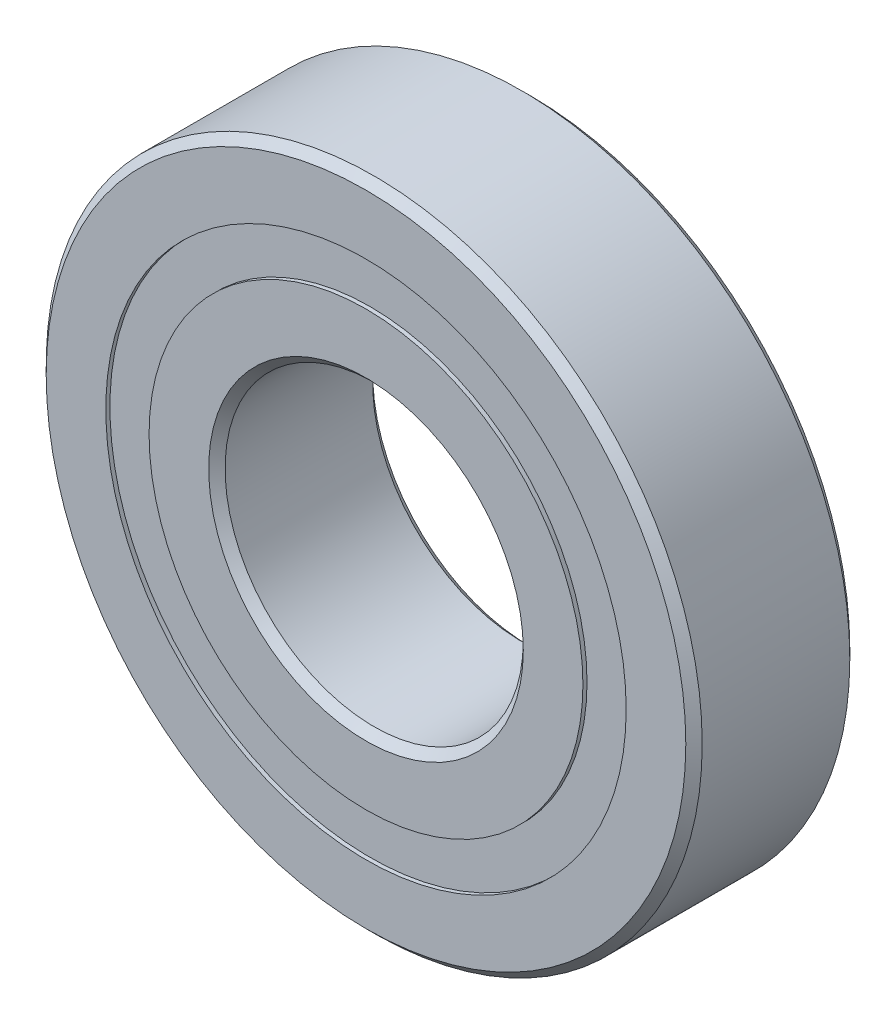
ISO-10303-21;
HEADER;
FILE_DESCRIPTION(('STEP AP214'),'2;1');
FILE_NAME('part.step','',(''),(''),'','','');
FILE_SCHEMA(('AUTOMOTIVE_DESIGN { 1 0 10303 214 1 1 1 1 }'));
ENDSEC;
DATA;
#1=APPLICATION_CONTEXT('core data for automotive mechanical design processes');
#2=APPLICATION_PROTOCOL_DEFINITION('international standard','automotive_design',2000,#1);
#3=PRODUCT_CONTEXT('',#1,'mechanical');
#4=PRODUCT('Part','Part','',(#3));
#5=PRODUCT_RELATED_PRODUCT_CATEGORY('part','',(#4));
#6=PRODUCT_DEFINITION_FORMATION('','',#4);
#7=PRODUCT_DEFINITION_CONTEXT('part definition',#1,'design');
#8=PRODUCT_DEFINITION('design','',#6,#7);
#9=PRODUCT_DEFINITION_SHAPE('','',#8);
#10=(LENGTH_UNIT() NAMED_UNIT(*) SI_UNIT(.MILLI.,.METRE.));
#11=(NAMED_UNIT(*) PLANE_ANGLE_UNIT() SI_UNIT($,.RADIAN.));
#12=(NAMED_UNIT(*) SI_UNIT($,.STERADIAN.) SOLID_ANGLE_UNIT());
#13=UNCERTAINTY_MEASURE_WITH_UNIT(LENGTH_MEASURE(1.E-05),#10,'distance_accuracy_value','');
#14=(GEOMETRIC_REPRESENTATION_CONTEXT(3) GLOBAL_UNCERTAINTY_ASSIGNED_CONTEXT((#13)) GLOBAL_UNIT_ASSIGNED_CONTEXT((#10,
#11,#12)) REPRESENTATION_CONTEXT('',''));
#15=CARTESIAN_POINT('',(0.,0.,0.));
#16=DIRECTION('',(0.,0.,1.));
#17=DIRECTION('',(1.,0.,0.));
#18=AXIS2_PLACEMENT_3D('',#15,#16,#17);
#19=CARTESIAN_POINT('',(0.,13.8513736263736,-4.14734375));
#20=DIRECTION('',(0.,0.,1.));
#21=DIRECTION('',(1.,0.,0.));
#22=AXIS2_PLACEMENT_3D('',#19,#20,#21);
#23=PLANE('',#22);
#24=CARTESIAN_POINT('',(0.,0.,-4.14734375));
#25=DIRECTION('',(0.,0.,1.));
#26=DIRECTION('',(1.,0.,0.));
#27=AXIS2_PLACEMENT_3D('',#24,#25,#26);
#28=CIRCLE('',#27,13.8513736263736);
#29=CARTESIAN_POINT('',(13.8513736263736,0.,-4.14734375));
#30=VERTEX_POINT('',#29);
#31=EDGE_CURVE('E55',#30,#30,#28,.T.);
#32=ORIENTED_EDGE('',*,*,#31,.F.);
#33=EDGE_LOOP('',(#32));
#34=FACE_BOUND('',#33,.T.);
#35=CARTESIAN_POINT('',(0.,0.,-4.14734375));
#36=DIRECTION('',(0.,0.,1.));
#37=DIRECTION('',(1.,0.,0.));
#38=AXIS2_PLACEMENT_3D('',#35,#36,#37);
#39=CIRCLE('',#38,11.5486263736264);
#40=CARTESIAN_POINT('',(11.5486263736264,0.,-4.14734375));
#41=VERTEX_POINT('',#40);
#42=EDGE_CURVE('E11',#41,#41,#39,.T.);
#43=ORIENTED_EDGE('',*,*,#42,.T.);
#44=EDGE_LOOP('',(#43));
#45=FACE_BOUND('',#44,.T.);
#46=ADVANCED_FACE('F41',(#34,#45),#23,.F.);
#47=CARTESIAN_POINT('',(0.,0.,4.365625));
#48=DIRECTION('',(0.,0.,1.));
#49=DIRECTION('',(1.,0.,0.));
#50=AXIS2_PLACEMENT_3D('',#47,#48,#49);
#51=CYLINDRICAL_SURFACE('',#50,11.5486263736264);
#52=ORIENTED_EDGE('',*,*,#42,.F.);
#53=EDGE_LOOP('',(#52));
#54=FACE_BOUND('',#53,.T.);
#55=CARTESIAN_POINT('',(0.,0.,-2.25617798111032));
#56=DIRECTION('',(0.,0.,1.));
#57=DIRECTION('',(1.,0.,0.));
#58=AXIS2_PLACEMENT_3D('',#55,#56,#57);
#59=CIRCLE('',#58,11.5486263736264);
#60=CARTESIAN_POINT('',(11.5486263736264,0.,-2.25617798111032));
#61=VERTEX_POINT('',#60);
#62=EDGE_CURVE('E47',#61,#61,#59,.T.);
#63=ORIENTED_EDGE('',*,*,#62,.T.);
#64=EDGE_LOOP('',(#63));
#65=FACE_BOUND('',#64,.T.);
#66=ADVANCED_FACE('F64',(#54,#65),#51,.F.);
#67=CARTESIAN_POINT('',(0.,13.8513736263736,-2.25617798111032));
#68=DIRECTION('',(0.,0.,-1.));
#69=DIRECTION('',(-1.,0.,0.));
#70=AXIS2_PLACEMENT_3D('',#67,#68,#69);
#71=PLANE('',#70);
#72=ORIENTED_EDGE('',*,*,#62,.F.);
#73=EDGE_LOOP('',(#72));
#74=FACE_BOUND('',#73,.T.);
#75=CARTESIAN_POINT('',(0.,0.,-2.25617798111032));
#76=DIRECTION('',(0.,0.,1.));
#77=DIRECTION('',(1.,0.,0.));
#78=AXIS2_PLACEMENT_3D('',#75,#76,#77);
#79=CIRCLE('',#78,13.8513736263736);
#80=CARTESIAN_POINT('',(13.8513736263736,0.,-2.25617798111032));
#81=VERTEX_POINT('',#80);
#82=EDGE_CURVE('E51',#81,#81,#79,.T.);
#83=ORIENTED_EDGE('',*,*,#82,.T.);
#84=EDGE_LOOP('',(#83));
#85=FACE_BOUND('',#84,.T.);
#86=ADVANCED_FACE('F68',(#74,#85),#71,.F.);
#87=CARTESIAN_POINT('',(0.,0.,4.365625));
#88=DIRECTION('',(0.,0.,1.));
#89=DIRECTION('',(1.,0.,0.));
#90=AXIS2_PLACEMENT_3D('',#87,#88,#89);
#91=CYLINDRICAL_SURFACE('',#90,13.8513736263736);
#92=ORIENTED_EDGE('',*,*,#82,.F.);
#93=EDGE_LOOP('',(#92));
#94=FACE_BOUND('',#93,.T.);
#95=ORIENTED_EDGE('',*,*,#31,.T.);
#96=EDGE_LOOP('',(#95));
#97=FACE_BOUND('',#96,.T.);
#98=ADVANCED_FACE('F61',(#94,#97),#91,.T.);
#99=CLOSED_SHELL('',(#46,#66,#86,#98));
#100=MANIFOLD_SOLID_BREP('B2',#99);
#101=CARTESIAN_POINT('',(0.,13.8513736263736,4.14734375));
#102=DIRECTION('',(0.,0.,-1.));
#103=DIRECTION('',(-1.,0.,0.));
#104=AXIS2_PLACEMENT_3D('',#101,#102,#103);
#105=PLANE('',#104);
#106=CARTESIAN_POINT('',(0.,0.,4.14734375));
#107=DIRECTION('',(0.,0.,1.));
#108=DIRECTION('',(1.,0.,0.));
#109=AXIS2_PLACEMENT_3D('',#106,#107,#108);
#110=CIRCLE('',#109,11.5486263736264);
#111=CARTESIAN_POINT('',(11.5486263736264,0.,4.14734375));
#112=VERTEX_POINT('',#111);
#113=EDGE_CURVE('E40',#112,#112,#110,.T.);
#114=ORIENTED_EDGE('',*,*,#113,.F.);
#115=EDGE_LOOP('',(#114));
#116=FACE_BOUND('',#115,.T.);
#117=CARTESIAN_POINT('',(0.,0.,4.14734375));
#118=DIRECTION('',(0.,0.,1.));
#119=DIRECTION('',(1.,0.,0.));
#120=AXIS2_PLACEMENT_3D('',#117,#118,#119);
#121=CIRCLE('',#120,13.8513736263736);
#122=CARTESIAN_POINT('',(13.8513736263736,0.,4.14734375));
#123=VERTEX_POINT('',#122);
#124=EDGE_CURVE('E122',#123,#123,#121,.T.);
#125=ORIENTED_EDGE('',*,*,#124,.T.);
#126=EDGE_LOOP('',(#125));
#127=FACE_BOUND('',#126,.T.);
#128=ADVANCED_FACE('F108',(#116,#127),#105,.F.);
#129=CARTESIAN_POINT('',(0.,0.,4.365625));
#130=DIRECTION('',(0.,0.,1.));
#131=DIRECTION('',(1.,0.,0.));
#132=AXIS2_PLACEMENT_3D('',#129,#130,#131);
#133=CYLINDRICAL_SURFACE('',#132,11.5486263736264);
#134=CARTESIAN_POINT('',(0.,0.,2.25617798111032));
#135=DIRECTION('',(0.,0.,1.));
#136=DIRECTION('',(1.,0.,0.));
#137=AXIS2_PLACEMENT_3D('',#134,#135,#136);
#138=CIRCLE('',#137,11.5486263736264);
#139=CARTESIAN_POINT('',(11.5486263736264,0.,2.25617798111032));
#140=VERTEX_POINT('',#139);
#141=EDGE_CURVE('E114',#140,#140,#138,.T.);
#142=ORIENTED_EDGE('',*,*,#141,.F.);
#143=EDGE_LOOP('',(#142));
#144=FACE_BOUND('',#143,.T.);
#145=ORIENTED_EDGE('',*,*,#113,.T.);
#146=EDGE_LOOP('',(#145));
#147=FACE_BOUND('',#146,.T.);
#148=ADVANCED_FACE('F137',(#144,#147),#133,.F.);
#149=CARTESIAN_POINT('',(0.,13.8513736263736,2.25617798111032));
#150=DIRECTION('',(0.,0.,1.));
#151=DIRECTION('',(1.,0.,0.));
#152=AXIS2_PLACEMENT_3D('',#149,#150,#151);
#153=PLANE('',#152);
#154=CARTESIAN_POINT('',(0.,0.,2.25617798111032));
#155=DIRECTION('',(0.,0.,1.));
#156=DIRECTION('',(1.,0.,0.));
#157=AXIS2_PLACEMENT_3D('',#154,#155,#156);
#158=CIRCLE('',#157,13.8513736263736);
#159=CARTESIAN_POINT('',(13.8513736263736,0.,2.25617798111032));
#160=VERTEX_POINT('',#159);
#161=EDGE_CURVE('E118',#160,#160,#158,.T.);
#162=ORIENTED_EDGE('',*,*,#161,.F.);
#163=EDGE_LOOP('',(#162));
#164=FACE_BOUND('',#163,.T.);
#165=ORIENTED_EDGE('',*,*,#141,.T.);
#166=EDGE_LOOP('',(#165));
#167=FACE_BOUND('',#166,.T.);
#168=ADVANCED_FACE('F132',(#164,#167),#153,.F.);
#169=CARTESIAN_POINT('',(0.,0.,4.365625));
#170=DIRECTION('',(0.,0.,1.));
#171=DIRECTION('',(1.,0.,0.));
#172=AXIS2_PLACEMENT_3D('',#169,#170,#171);
#173=CYLINDRICAL_SURFACE('',#172,13.8513736263736);
#174=ORIENTED_EDGE('',*,*,#124,.F.);
#175=EDGE_LOOP('',(#174));
#176=FACE_BOUND('',#175,.T.);
#177=ORIENTED_EDGE('',*,*,#161,.T.);
#178=EDGE_LOOP('',(#177));
#179=FACE_BOUND('',#178,.T.);
#180=ADVANCED_FACE('F129',(#176,#179),#173,.T.);
#181=CLOSED_SHELL('',(#128,#148,#168,#180));
#182=MANIFOLD_SOLID_BREP('B6',#181);
#183=CARTESIAN_POINT('',(-7.46487270411427,10.2745158285619,0.));
#184=DIRECTION('',(0.,0.,1.));
#185=DIRECTION('',(-0.587785252292462,0.809016994374955,0.));
#186=AXIS2_PLACEMENT_3D('',#183,#184,#185);
#187=SPHERICAL_SURFACE('',#186,2.25617798111032);
#188=CARTESIAN_POINT('',(-7.46487270411427,10.2745158285619,2.25617798111032));
#189=VERTEX_POINT('',#188);
#190=VERTEX_LOOP('',#189);
#191=FACE_BOUND('',#190,.T.);
#192=ADVANCED_FACE('F175',(#191),#187,.T.);
#193=CLOSED_SHELL('',(#192));
#194=MANIFOLD_SOLID_BREP('B35',#193);
#195=CARTESIAN_POINT('',(-12.0784177569484,3.92451582856197,0.));
#196=DIRECTION('',(0.,0.,1.));
#197=DIRECTION('',(-0.95105651629515,0.309016994374958,0.));
#198=AXIS2_PLACEMENT_3D('',#195,#196,#197);
#199=SPHERICAL_SURFACE('',#198,2.25617798111032);
#200=CARTESIAN_POINT('',(-12.0784177569484,3.92451582856197,2.25617798111032));
#201=VERTEX_POINT('',#200);
#202=VERTEX_LOOP('',#201);
#203=FACE_BOUND('',#202,.T.);
#204=ADVANCED_FACE('F195',(#203),#199,.T.);
#205=CLOSED_SHELL('',(#204));
#206=MANIFOLD_SOLID_BREP('B104',#205);
#207=CARTESIAN_POINT('',(-12.0784177569485,-3.92451582856172,0.));
#208=DIRECTION('',(0.,0.,1.));
#209=DIRECTION('',(-0.951056516295157,-0.309016994374938,0.));
#210=AXIS2_PLACEMENT_3D('',#207,#208,#209);
#211=SPHERICAL_SURFACE('',#210,2.25617798111032);
#212=CARTESIAN_POINT('',(-12.0784177569485,-3.92451582856172,2.25617798111032));
#213=VERTEX_POINT('',#212);
#214=VERTEX_LOOP('',#213);
#215=FACE_BOUND('',#214,.T.);
#216=ADVANCED_FACE('F215',(#215),#211,.T.);
#217=CLOSED_SHELL('',(#216));
#218=MANIFOLD_SOLID_BREP('B171',#217);
#219=CARTESIAN_POINT('',(-7.4648727041145,-10.2745158285618,0.));
#220=DIRECTION('',(0.,0.,1.));
#221=DIRECTION('',(-0.58778525229248,-0.809016994374942,0.));
#222=AXIS2_PLACEMENT_3D('',#219,#220,#221);
#223=SPHERICAL_SURFACE('',#222,2.25617798111032);
#224=CARTESIAN_POINT('',(-7.4648727041145,-10.2745158285618,2.25617798111032));
#225=VERTEX_POINT('',#224);
#226=VERTEX_LOOP('',#225);
#227=FACE_BOUND('',#226,.T.);
#228=ADVANCED_FACE('F235',(#227),#223,.T.);
#229=CLOSED_SHELL('',(#228));
#230=MANIFOLD_SOLID_BREP('B191',#229);
#231=CARTESIAN_POINT('',(0.,-12.7,0.));
#232=DIRECTION('',(0.,0.,1.));
#233=DIRECTION('',(0.,-1.,0.));
#234=AXIS2_PLACEMENT_3D('',#231,#232,#233);
#235=SPHERICAL_SURFACE('',#234,2.25617798111032);
#236=CARTESIAN_POINT('',(0.,-12.7,2.25617798111032));
#237=VERTEX_POINT('',#236);
#238=VERTEX_LOOP('',#237);
#239=FACE_BOUND('',#238,.T.);
#240=ADVANCED_FACE('F255',(#239),#235,.T.);
#241=CLOSED_SHELL('',(#240));
#242=MANIFOLD_SOLID_BREP('B211',#241);
#243=CARTESIAN_POINT('',(7.46487270411435,-10.2745158285619,0.));
#244=DIRECTION('',(0.,0.,1.));
#245=DIRECTION('',(0.587785252292469,-0.809016994374951,0.));
#246=AXIS2_PLACEMENT_3D('',#243,#244,#245);
#247=SPHERICAL_SURFACE('',#246,2.25617798111032);
#248=CARTESIAN_POINT('',(7.46487270411435,-10.2745158285619,2.25617798111032));
#249=VERTEX_POINT('',#248);
#250=VERTEX_LOOP('',#249);
#251=FACE_BOUND('',#250,.T.);
#252=ADVANCED_FACE('F275',(#251),#247,.T.);
#253=CLOSED_SHELL('',(#252));
#254=MANIFOLD_SOLID_BREP('B231',#253);
#255=CARTESIAN_POINT('',(12.0784177569484,-3.92451582856189,0.));
#256=DIRECTION('',(0.,0.,1.));
#257=DIRECTION('',(0.951056516295152,-0.309016994374952,0.));
#258=AXIS2_PLACEMENT_3D('',#255,#256,#257);
#259=SPHERICAL_SURFACE('',#258,2.25617798111032);
#260=CARTESIAN_POINT('',(12.0784177569484,-3.92451582856189,2.25617798111032));
#261=VERTEX_POINT('',#260);
#262=VERTEX_LOOP('',#261);
#263=FACE_BOUND('',#262,.T.);
#264=ADVANCED_FACE('F295',(#263),#259,.T.);
#265=CLOSED_SHELL('',(#264));
#266=MANIFOLD_SOLID_BREP('B251',#265);
#267=CARTESIAN_POINT('',(12.0784177569485,3.9245158285618,0.));
#268=DIRECTION('',(0.,0.,1.));
#269=DIRECTION('',(0.951056516295155,0.309016994374945,0.));
#270=AXIS2_PLACEMENT_3D('',#267,#268,#269);
#271=SPHERICAL_SURFACE('',#270,2.25617798111032);
#272=CARTESIAN_POINT('',(12.0784177569485,3.9245158285618,2.25617798111032));
#273=VERTEX_POINT('',#272);
#274=VERTEX_LOOP('',#273);
#275=FACE_BOUND('',#274,.T.);
#276=ADVANCED_FACE('F315',(#275),#271,.T.);
#277=CLOSED_SHELL('',(#276));
#278=MANIFOLD_SOLID_BREP('B271',#277);
#279=CARTESIAN_POINT('',(7.46487270411442,10.2745158285618,0.));
#280=DIRECTION('',(0.,0.,1.));
#281=DIRECTION('',(0.587785252292474,0.809016994374947,0.));
#282=AXIS2_PLACEMENT_3D('',#279,#280,#281);
#283=SPHERICAL_SURFACE('',#282,2.25617798111032);
#284=CARTESIAN_POINT('',(7.46487270411442,10.2745158285618,2.25617798111032));
#285=VERTEX_POINT('',#284);
#286=VERTEX_LOOP('',#285);
#287=FACE_BOUND('',#286,.T.);
#288=ADVANCED_FACE('F335',(#287),#283,.T.);
#289=CLOSED_SHELL('',(#288));
#290=MANIFOLD_SOLID_BREP('B291',#289);
#291=CARTESIAN_POINT('',(0.,12.7,0.));
#292=DIRECTION('',(0.,0.,1.));
#293=DIRECTION('',(0.,1.,0.));
#294=AXIS2_PLACEMENT_3D('',#291,#292,#293);
#295=SPHERICAL_SURFACE('',#294,2.25617798111032);
#296=CARTESIAN_POINT('',(0.,12.7,2.25617798111032));
#297=VERTEX_POINT('',#296);
#298=VERTEX_LOOP('',#297);
#299=FACE_BOUND('',#298,.T.);
#300=ADVANCED_FACE('F357',(#299),#295,.T.);
#301=CLOSED_SHELL('',(#300));
#302=MANIFOLD_SOLID_BREP('B311',#301);
#303=CARTESIAN_POINT('',(0.,11.5486263736264,4.365625));
#304=DIRECTION('',(0.,0.,-1.));
#305=DIRECTION('',(-1.,0.,0.));
#306=AXIS2_PLACEMENT_3D('',#303,#304,#305);
#307=PLANE('',#306);
#308=CARTESIAN_POINT('',(0.,0.,4.365625));
#309=DIRECTION('',(0.,0.,1.));
#310=DIRECTION('',(1.,0.,0.));
#311=AXIS2_PLACEMENT_3D('',#308,#309,#310);
#312=CIRCLE('',#311,8.3740625);
#313=CARTESIAN_POINT('',(8.3740625,0.,4.365625));
#314=VERTEX_POINT('',#313);
#315=EDGE_CURVE('E404',#314,#314,#312,.T.);
#316=ORIENTED_EDGE('',*,*,#315,.F.);
#317=EDGE_LOOP('',(#316));
#318=FACE_BOUND('',#317,.T.);
#319=CARTESIAN_POINT('',(0.,0.,4.365625));
#320=DIRECTION('',(0.,0.,1.));
#321=DIRECTION('',(1.,0.,0.));
#322=AXIS2_PLACEMENT_3D('',#319,#320,#321);
#323=CIRCLE('',#322,11.5486263736264);
#324=CARTESIAN_POINT('',(11.5486263736264,0.,4.365625));
#325=VERTEX_POINT('',#324);
#326=EDGE_CURVE('E356',#325,#325,#323,.T.);
#327=ORIENTED_EDGE('',*,*,#326,.T.);
#328=EDGE_LOOP('',(#327));
#329=FACE_BOUND('',#328,.T.);
#330=ADVANCED_FACE('F376',(#318,#329),#307,.F.);
#331=CARTESIAN_POINT('',(0.,0.,4.365625));
#332=DIRECTION('',(0.,0.,1.));
#333=DIRECTION('',(1.,0.,0.));
#334=AXIS2_PLACEMENT_3D('',#331,#332,#333);
#335=CYLINDRICAL_SURFACE('',#334,11.5486263736264);
#336=ORIENTED_EDGE('',*,*,#326,.F.);
#337=EDGE_LOOP('',(#336));
#338=FACE_BOUND('',#337,.T.);
#339=CARTESIAN_POINT('',(0.,0.,1.94027777777778));
#340=DIRECTION('',(0.,0.,1.));
#341=DIRECTION('',(1.,0.,0.));
#342=AXIS2_PLACEMENT_3D('',#339,#340,#341);
#343=CIRCLE('',#342,11.5486263736264);
#344=CARTESIAN_POINT('',(11.5486263736264,0.,1.94027777777778));
#345=VERTEX_POINT('',#344);
#346=EDGE_CURVE('E382',#345,#345,#343,.T.);
#347=ORIENTED_EDGE('',*,*,#346,.T.);
#348=EDGE_LOOP('',(#347));
#349=FACE_BOUND('',#348,.T.);
#350=ADVANCED_FACE('F411',(#338,#349),#335,.T.);
#351=CARTESIAN_POINT('',(0.,0.,0.));
#352=DIRECTION('',(0.,0.,1.));
#353=DIRECTION('',(1.,0.,0.));
#354=AXIS2_PLACEMENT_3D('',#351,#352,#353);
#355=TOROIDAL_SURFACE('',#354,12.7,2.25617798111031);
#356=ORIENTED_EDGE('',*,*,#346,.F.);
#357=EDGE_LOOP('',(#356));
#358=FACE_BOUND('',#357,.T.);
#359=CARTESIAN_POINT('',(0.,0.,-1.94027777777778));
#360=DIRECTION('',(0.,0.,1.));
#361=DIRECTION('',(1.,0.,0.));
#362=AXIS2_PLACEMENT_3D('',#359,#360,#361);
#363=CIRCLE('',#362,11.5486263736264);
#364=CARTESIAN_POINT('',(11.5486263736264,0.,-1.94027777777778));
#365=VERTEX_POINT('',#364);
#366=EDGE_CURVE('E386',#365,#365,#363,.T.);
#367=ORIENTED_EDGE('',*,*,#366,.T.);
#368=EDGE_LOOP('',(#367));
#369=FACE_BOUND('',#368,.T.);
#370=ADVANCED_FACE('F415',(#358,#369),#355,.F.);
#371=CARTESIAN_POINT('',(0.,0.,4.365625));
#372=DIRECTION('',(0.,0.,1.));
#373=DIRECTION('',(1.,0.,0.));
#374=AXIS2_PLACEMENT_3D('',#371,#372,#373);
#375=CYLINDRICAL_SURFACE('',#374,11.5486263736264);
#376=ORIENTED_EDGE('',*,*,#366,.F.);
#377=EDGE_LOOP('',(#376));
#378=FACE_BOUND('',#377,.T.);
#379=CARTESIAN_POINT('',(0.,0.,-4.365625));
#380=DIRECTION('',(0.,0.,1.));
#381=DIRECTION('',(1.,0.,0.));
#382=AXIS2_PLACEMENT_3D('',#379,#380,#381);
#383=CIRCLE('',#382,11.5486263736264);
#384=CARTESIAN_POINT('',(11.5486263736264,0.,-4.365625));
#385=VERTEX_POINT('',#384);
#386=EDGE_CURVE('E390',#385,#385,#383,.T.);
#387=ORIENTED_EDGE('',*,*,#386,.T.);
#388=EDGE_LOOP('',(#387));
#389=FACE_BOUND('',#388,.T.);
#390=ADVANCED_FACE('F420',(#378,#389),#375,.T.);
#391=CARTESIAN_POINT('',(0.,8.3740625,-4.365625));
#392=DIRECTION('',(0.,0.,1.));
#393=DIRECTION('',(1.,0.,0.));
#394=AXIS2_PLACEMENT_3D('',#391,#392,#393);
#395=PLANE('',#394);
#396=ORIENTED_EDGE('',*,*,#386,.F.);
#397=EDGE_LOOP('',(#396));
#398=FACE_BOUND('',#397,.T.);
#399=CARTESIAN_POINT('',(0.,0.,-4.365625));
#400=DIRECTION('',(0.,0.,1.));
#401=DIRECTION('',(1.,0.,0.));
#402=AXIS2_PLACEMENT_3D('',#399,#400,#401);
#403=CIRCLE('',#402,8.3740625);
#404=CARTESIAN_POINT('',(8.3740625,0.,-4.365625));
#405=VERTEX_POINT('',#404);
#406=EDGE_CURVE('E395',#405,#405,#403,.T.);
#407=ORIENTED_EDGE('',*,*,#406,.T.);
#408=EDGE_LOOP('',(#407));
#409=FACE_BOUND('',#408,.T.);
#410=ADVANCED_FACE('F426',(#398,#409),#395,.F.);
#411=CARTESIAN_POINT('',(0.,0.,-3.9290625));
#412=DIRECTION('',(0.,0.,-1.));
#413=DIRECTION('',(-1.,0.,0.));
#414=AXIS2_PLACEMENT_3D('',#411,#412,#413);
#415=CONICAL_SURFACE('',#414,7.9375,0.785398163397446);
#416=ORIENTED_EDGE('',*,*,#406,.F.);
#417=EDGE_LOOP('',(#416));
#418=FACE_BOUND('',#417,.T.);
#419=CARTESIAN_POINT('',(0.,0.,-3.9290625));
#420=DIRECTION('',(0.,0.,1.));
#421=DIRECTION('',(1.,0.,0.));
#422=AXIS2_PLACEMENT_3D('',#419,#420,#421);
#423=CIRCLE('',#422,7.9375);
#424=CARTESIAN_POINT('',(7.9375,0.,-3.9290625));
#425=VERTEX_POINT('',#424);
#426=EDGE_CURVE('E398',#425,#425,#423,.T.);
#427=ORIENTED_EDGE('',*,*,#426,.T.);
#428=EDGE_LOOP('',(#427));
#429=FACE_BOUND('',#428,.T.);
#430=ADVANCED_FACE('F430',(#418,#429),#415,.F.);
#431=CARTESIAN_POINT('',(0.,0.,4.365625));
#432=DIRECTION('',(0.,0.,1.));
#433=DIRECTION('',(1.,0.,0.));
#434=AXIS2_PLACEMENT_3D('',#431,#432,#433);
#435=CYLINDRICAL_SURFACE('',#434,7.9375);
#436=ORIENTED_EDGE('',*,*,#426,.F.);
#437=EDGE_LOOP('',(#436));
#438=FACE_BOUND('',#437,.T.);
#439=CARTESIAN_POINT('',(0.,0.,3.9290625));
#440=DIRECTION('',(0.,0.,1.));
#441=DIRECTION('',(1.,0.,0.));
#442=AXIS2_PLACEMENT_3D('',#439,#440,#441);
#443=CIRCLE('',#442,7.9375);
#444=CARTESIAN_POINT('',(7.9375,0.,3.9290625));
#445=VERTEX_POINT('',#444);
#446=EDGE_CURVE('E401',#445,#445,#443,.T.);
#447=ORIENTED_EDGE('',*,*,#446,.T.);
#448=EDGE_LOOP('',(#447));
#449=FACE_BOUND('',#448,.T.);
#450=ADVANCED_FACE('F434',(#438,#449),#435,.F.);
#451=CARTESIAN_POINT('',(0.,0.,4.365625));
#452=DIRECTION('',(0.,0.,1.));
#453=DIRECTION('',(1.,0.,0.));
#454=AXIS2_PLACEMENT_3D('',#451,#452,#453);
#455=CONICAL_SURFACE('',#454,8.3740625,0.78539816339745);
#456=ORIENTED_EDGE('',*,*,#446,.F.);
#457=EDGE_LOOP('',(#456));
#458=FACE_BOUND('',#457,.T.);
#459=ORIENTED_EDGE('',*,*,#315,.T.);
#460=EDGE_LOOP('',(#459));
#461=FACE_BOUND('',#460,.T.);
#462=ADVANCED_FACE('F408',(#458,#461),#455,.F.);
#463=CLOSED_SHELL('',(#330,#350,#370,#390,#410,#430,#450,#462));
#464=MANIFOLD_SOLID_BREP('B331',#463);
#465=CARTESIAN_POINT('',(0.,0.,3.9290625));
#466=DIRECTION('',(0.,0.,-1.));
#467=DIRECTION('',(-1.,0.,0.));
#468=AXIS2_PLACEMENT_3D('',#465,#466,#467);
#469=CONICAL_SURFACE('',#468,17.4625,0.785398163397445);
#470=CARTESIAN_POINT('',(0.,0.,4.365625));
#471=DIRECTION('',(0.,0.,1.));
#472=DIRECTION('',(1.,0.,0.));
#473=AXIS2_PLACEMENT_3D('',#470,#471,#472);
#474=CIRCLE('',#473,17.0259375);
#475=CARTESIAN_POINT('',(17.0259375,0.,4.365625));
#476=VERTEX_POINT('',#475);
#477=EDGE_CURVE('E525',#476,#476,#474,.T.);
#478=ORIENTED_EDGE('',*,*,#477,.F.);
#479=EDGE_LOOP('',(#478));
#480=FACE_BOUND('',#479,.T.);
#481=CARTESIAN_POINT('',(0.,0.,3.9290625));
#482=DIRECTION('',(0.,0.,1.));
#483=DIRECTION('',(1.,0.,0.));
#484=AXIS2_PLACEMENT_3D('',#481,#482,#483);
#485=CIRCLE('',#484,17.4625);
#486=CARTESIAN_POINT('',(17.4625,0.,3.9290625));
#487=VERTEX_POINT('',#486);
#488=EDGE_CURVE('E375',#487,#487,#485,.T.);
#489=ORIENTED_EDGE('',*,*,#488,.T.);
#490=EDGE_LOOP('',(#489));
#491=FACE_BOUND('',#490,.T.);
#492=ADVANCED_FACE('F497',(#480,#491),#469,.T.);
#493=CARTESIAN_POINT('',(0.,0.,4.365625));
#494=DIRECTION('',(0.,0.,1.));
#495=DIRECTION('',(1.,0.,0.));
#496=AXIS2_PLACEMENT_3D('',#493,#494,#495);
#497=CYLINDRICAL_SURFACE('',#496,17.4625);
#498=ORIENTED_EDGE('',*,*,#488,.F.);
#499=EDGE_LOOP('',(#498));
#500=FACE_BOUND('',#499,.T.);
#501=CARTESIAN_POINT('',(0.,0.,-3.9290625));
#502=DIRECTION('',(0.,0.,1.));
#503=DIRECTION('',(1.,0.,0.));
#504=AXIS2_PLACEMENT_3D('',#501,#502,#503);
#505=CIRCLE('',#504,17.4625);
#506=CARTESIAN_POINT('',(17.4625,0.,-3.9290625));
#507=VERTEX_POINT('',#506);
#508=EDGE_CURVE('E503',#507,#507,#505,.T.);
#509=ORIENTED_EDGE('',*,*,#508,.T.);
#510=EDGE_LOOP('',(#509));
#511=FACE_BOUND('',#510,.T.);
#512=ADVANCED_FACE('F532',(#500,#511),#497,.T.);
#513=CARTESIAN_POINT('',(0.,0.,-4.365625));
#514=DIRECTION('',(0.,0.,1.));
#515=DIRECTION('',(1.,0.,0.));
#516=AXIS2_PLACEMENT_3D('',#513,#514,#515);
#517=CONICAL_SURFACE('',#516,17.0259375,0.785398163397446);
#518=ORIENTED_EDGE('',*,*,#508,.F.);
#519=EDGE_LOOP('',(#518));
#520=FACE_BOUND('',#519,.T.);
#521=CARTESIAN_POINT('',(0.,0.,-4.365625));
#522=DIRECTION('',(0.,0.,1.));
#523=DIRECTION('',(1.,0.,0.));
#524=AXIS2_PLACEMENT_3D('',#521,#522,#523);
#525=CIRCLE('',#524,17.0259375);
#526=CARTESIAN_POINT('',(17.0259375,0.,-4.365625));
#527=VERTEX_POINT('',#526);
#528=EDGE_CURVE('E507',#527,#527,#525,.T.);
#529=ORIENTED_EDGE('',*,*,#528,.T.);
#530=EDGE_LOOP('',(#529));
#531=FACE_BOUND('',#530,.T.);
#532=ADVANCED_FACE('F536',(#520,#531),#517,.T.);
#533=CARTESIAN_POINT('',(0.,17.0259375,-4.365625));
#534=DIRECTION('',(0.,0.,1.));
#535=DIRECTION('',(1.,0.,0.));
#536=AXIS2_PLACEMENT_3D('',#533,#534,#535);
#537=PLANE('',#536);
#538=ORIENTED_EDGE('',*,*,#528,.F.);
#539=EDGE_LOOP('',(#538));
#540=FACE_BOUND('',#539,.T.);
#541=CARTESIAN_POINT('',(0.,0.,-4.365625));
#542=DIRECTION('',(0.,0.,1.));
#543=DIRECTION('',(1.,0.,0.));
#544=AXIS2_PLACEMENT_3D('',#541,#542,#543);
#545=CIRCLE('',#544,13.8513736263736);
#546=CARTESIAN_POINT('',(13.8513736263736,0.,-4.365625));
#547=VERTEX_POINT('',#546);
#548=EDGE_CURVE('E511',#547,#547,#545,.T.);
#549=ORIENTED_EDGE('',*,*,#548,.T.);
#550=EDGE_LOOP('',(#549));
#551=FACE_BOUND('',#550,.T.);
#552=ADVANCED_FACE('F541',(#540,#551),#537,.F.);
#553=CARTESIAN_POINT('',(0.,0.,4.365625));
#554=DIRECTION('',(0.,0.,1.));
#555=DIRECTION('',(1.,0.,0.));
#556=AXIS2_PLACEMENT_3D('',#553,#554,#555);
#557=CYLINDRICAL_SURFACE('',#556,13.8513736263736);
#558=ORIENTED_EDGE('',*,*,#548,.F.);
#559=EDGE_LOOP('',(#558));
#560=FACE_BOUND('',#559,.T.);
#561=CARTESIAN_POINT('',(0.,0.,-1.94027777777778));
#562=DIRECTION('',(0.,0.,1.));
#563=DIRECTION('',(1.,0.,0.));
#564=AXIS2_PLACEMENT_3D('',#561,#562,#563);
#565=CIRCLE('',#564,13.8513736263736);
#566=CARTESIAN_POINT('',(13.8513736263736,0.,-1.94027777777778));
#567=VERTEX_POINT('',#566);
#568=EDGE_CURVE('E516',#567,#567,#565,.T.);
#569=ORIENTED_EDGE('',*,*,#568,.T.);
#570=EDGE_LOOP('',(#569));
#571=FACE_BOUND('',#570,.T.);
#572=ADVANCED_FACE('F547',(#560,#571),#557,.F.);
#573=CARTESIAN_POINT('',(0.,0.,0.));
#574=DIRECTION('',(0.,0.,1.));
#575=DIRECTION('',(1.,0.,0.));
#576=AXIS2_PLACEMENT_3D('',#573,#574,#575);
#577=TOROIDAL_SURFACE('',#576,12.7,2.25617798111032);
#578=ORIENTED_EDGE('',*,*,#568,.F.);
#579=EDGE_LOOP('',(#578));
#580=FACE_BOUND('',#579,.T.);
#581=CARTESIAN_POINT('',(0.,0.,1.94027777777778));
#582=DIRECTION('',(0.,0.,1.));
#583=DIRECTION('',(1.,0.,0.));
#584=AXIS2_PLACEMENT_3D('',#581,#582,#583);
#585=CIRCLE('',#584,13.8513736263736);
#586=CARTESIAN_POINT('',(13.8513736263736,0.,1.94027777777778));
#587=VERTEX_POINT('',#586);
#588=EDGE_CURVE('E519',#587,#587,#585,.T.);
#589=ORIENTED_EDGE('',*,*,#588,.T.);
#590=EDGE_LOOP('',(#589));
#591=FACE_BOUND('',#590,.T.);
#592=ADVANCED_FACE('F551',(#580,#591),#577,.F.);
#593=CARTESIAN_POINT('',(0.,0.,4.365625));
#594=DIRECTION('',(0.,0.,1.));
#595=DIRECTION('',(1.,0.,0.));
#596=AXIS2_PLACEMENT_3D('',#593,#594,#595);
#597=CYLINDRICAL_SURFACE('',#596,13.8513736263736);
#598=ORIENTED_EDGE('',*,*,#588,.F.);
#599=EDGE_LOOP('',(#598));
#600=FACE_BOUND('',#599,.T.);
#601=CARTESIAN_POINT('',(0.,0.,4.365625));
#602=DIRECTION('',(0.,0.,1.));
#603=DIRECTION('',(1.,0.,0.));
#604=AXIS2_PLACEMENT_3D('',#601,#602,#603);
#605=CIRCLE('',#604,13.8513736263736);
#606=CARTESIAN_POINT('',(13.8513736263736,0.,4.365625));
#607=VERTEX_POINT('',#606);
#608=EDGE_CURVE('E522',#607,#607,#605,.T.);
#609=ORIENTED_EDGE('',*,*,#608,.T.);
#610=EDGE_LOOP('',(#609));
#611=FACE_BOUND('',#610,.T.);
#612=ADVANCED_FACE('F555',(#600,#611),#597,.F.);
#613=CARTESIAN_POINT('',(0.,17.0259375,4.365625));
#614=DIRECTION('',(0.,0.,-1.));
#615=DIRECTION('',(-1.,0.,0.));
#616=AXIS2_PLACEMENT_3D('',#613,#614,#615);
#617=PLANE('',#616);
#618=ORIENTED_EDGE('',*,*,#608,.F.);
#619=EDGE_LOOP('',(#618));
#620=FACE_BOUND('',#619,.T.);
#621=ORIENTED_EDGE('',*,*,#477,.T.);
#622=EDGE_LOOP('',(#621));
#623=FACE_BOUND('',#622,.T.);
#624=ADVANCED_FACE('F529',(#620,#623),#617,.F.);
#625=CLOSED_SHELL('',(#492,#512,#532,#552,#572,#592,#612,#624));
#626=MANIFOLD_SOLID_BREP('B351',#625);
#627=ADVANCED_BREP_SHAPE_REPRESENTATION('',(#18,#100,#182,#194,#206,#218,#230,#242,#254,#266,
#278,#290,#302,#464,#626),#14);
#628=SHAPE_DEFINITION_REPRESENTATION(#9,#627);
ENDSEC;
END-ISO-10303-21;
